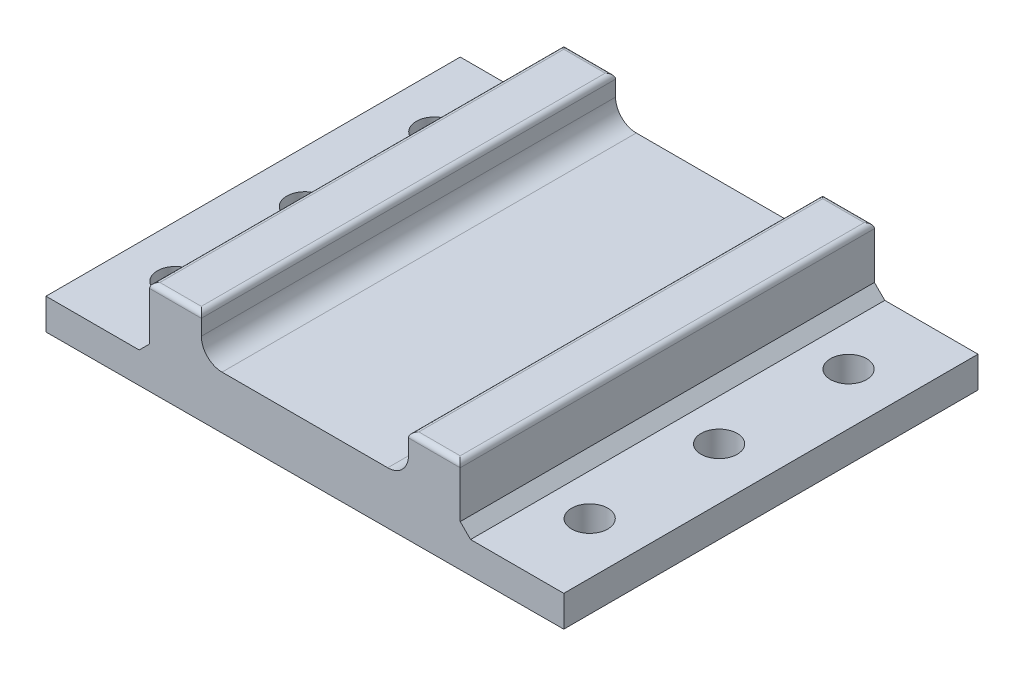
ISO-10303-21;
HEADER;
FILE_DESCRIPTION(('STEP AP214'),'2;1');
FILE_NAME('part.step','',(''),(''),'','','');
FILE_SCHEMA(('AUTOMOTIVE_DESIGN { 1 0 10303 214 1 1 1 1 }'));
ENDSEC;
DATA;
#1=APPLICATION_CONTEXT('core data for automotive mechanical design processes');
#2=APPLICATION_PROTOCOL_DEFINITION('international standard','automotive_design',2000,#1);
#3=PRODUCT_CONTEXT('',#1,'mechanical');
#4=PRODUCT('Part','Part','',(#3));
#5=PRODUCT_RELATED_PRODUCT_CATEGORY('part','',(#4));
#6=PRODUCT_DEFINITION_FORMATION('','',#4);
#7=PRODUCT_DEFINITION_CONTEXT('part definition',#1,'design');
#8=PRODUCT_DEFINITION('design','',#6,#7);
#9=PRODUCT_DEFINITION_SHAPE('','',#8);
#10=(LENGTH_UNIT() NAMED_UNIT(*) SI_UNIT(.MILLI.,.METRE.));
#11=(NAMED_UNIT(*) PLANE_ANGLE_UNIT() SI_UNIT($,.RADIAN.));
#12=(NAMED_UNIT(*) SI_UNIT($,.STERADIAN.) SOLID_ANGLE_UNIT());
#13=UNCERTAINTY_MEASURE_WITH_UNIT(LENGTH_MEASURE(1.E-05),#10,'distance_accuracy_value','');
#14=(GEOMETRIC_REPRESENTATION_CONTEXT(3) GLOBAL_UNCERTAINTY_ASSIGNED_CONTEXT((#13)) GLOBAL_UNIT_ASSIGNED_CONTEXT((#10,
#11,#12)) REPRESENTATION_CONTEXT('',''));
#15=CARTESIAN_POINT('',(0.,0.,0.));
#16=DIRECTION('',(0.,0.,1.));
#17=DIRECTION('',(1.,0.,0.));
#18=AXIS2_PLACEMENT_3D('',#15,#16,#17);
#19=CARTESIAN_POINT('',(0.,-12.2989214175655,-80.));
#20=DIRECTION('',(-1.,0.,0.));
#21=DIRECTION('',(0.,0.,1.));
#22=AXIS2_PLACEMENT_3D('',#19,#20,#21);
#23=PLANE('',#22);
#24=DIRECTION('',(0.,-1.,0.));
#25=VECTOR('',#24,1.);
#26=CARTESIAN_POINT('',(0.,-12.2989214175655,0.));
#27=LINE('',#26,#25);
#28=CARTESIAN_POINT('',(0.,-1.,0.));
#29=VERTEX_POINT('',#28);
#30=CARTESIAN_POINT('',(0.,-10.2989214175655,0.));
#31=VERTEX_POINT('',#30);
#32=EDGE_CURVE('E228',#29,#31,#27,.T.);
#33=ORIENTED_EDGE('',*,*,#32,.F.);
#34=DIRECTION('',(0.,0.,1.));
#35=VECTOR('',#34,1.);
#36=CARTESIAN_POINT('',(0.,-1.,-80.));
#37=LINE('',#36,#35);
#38=CARTESIAN_POINT('',(0.,-1.,-80.));
#39=VERTEX_POINT('',#38);
#40=EDGE_CURVE('E315',#29,#39,#37,.F.);
#41=ORIENTED_EDGE('',*,*,#40,.T.);
#42=DIRECTION('',(0.,-1.,0.));
#43=VECTOR('',#42,1.);
#44=CARTESIAN_POINT('',(0.,-12.2989214175655,-80.));
#45=LINE('',#44,#43);
#46=CARTESIAN_POINT('',(0.,-10.2989214175655,-80.));
#47=VERTEX_POINT('',#46);
#48=EDGE_CURVE('E192',#39,#47,#45,.T.);
#49=ORIENTED_EDGE('',*,*,#48,.T.);
#50=DIRECTION('',(0.,0.,1.));
#51=VECTOR('',#50,1.);
#52=CARTESIAN_POINT('',(0.,-10.2989214175655,0.));
#53=LINE('',#52,#51);
#54=EDGE_CURVE('E256',#47,#31,#53,.T.);
#55=ORIENTED_EDGE('',*,*,#54,.T.);
#56=EDGE_LOOP('',(#33,#41,#49,#55));
#57=FACE_BOUND('',#56,.T.);
#58=ADVANCED_FACE('F41',(#57),#23,.T.);
#59=CARTESIAN_POINT('',(0.,0.,-80.));
#60=DIRECTION('',(0.,1.,0.));
#61=DIRECTION('',(0.,0.,1.));
#62=AXIS2_PLACEMENT_3D('',#59,#60,#61);
#63=PLANE('',#62);
#64=DIRECTION('',(-1.,0.,0.));
#65=VECTOR('',#64,1.);
#66=CARTESIAN_POINT('',(0.,0.,-79.));
#67=LINE('',#66,#65);
#68=CARTESIAN_POINT('',(9.,0.,-79.));
#69=VERTEX_POINT('',#68);
#70=CARTESIAN_POINT('',(1.,0.,-79.));
#71=VERTEX_POINT('',#70);
#72=EDGE_CURVE('E310',#69,#71,#67,.T.);
#73=ORIENTED_EDGE('',*,*,#72,.T.);
#74=DIRECTION('',(0.,0.,1.));
#75=VECTOR('',#74,1.);
#76=CARTESIAN_POINT('',(1.,0.,-80.));
#77=LINE('',#76,#75);
#78=CARTESIAN_POINT('',(1.,0.,-1.));
#79=VERTEX_POINT('',#78);
#80=EDGE_CURVE('E312',#71,#79,#77,.T.);
#81=ORIENTED_EDGE('',*,*,#80,.T.);
#82=DIRECTION('',(-1.,0.,0.));
#83=VECTOR('',#82,1.);
#84=CARTESIAN_POINT('',(10.,0.,-1.));
#85=LINE('',#84,#83);
#86=CARTESIAN_POINT('',(9.,0.,-1.));
#87=VERTEX_POINT('',#86);
#88=EDGE_CURVE('E306',#79,#87,#85,.F.);
#89=ORIENTED_EDGE('',*,*,#88,.T.);
#90=DIRECTION('',(0.,0.,1.));
#91=VECTOR('',#90,1.);
#92=CARTESIAN_POINT('',(9.,0.,-80.));
#93=LINE('',#92,#91);
#94=EDGE_CURVE('E308',#87,#69,#93,.F.);
#95=ORIENTED_EDGE('',*,*,#94,.T.);
#96=EDGE_LOOP('',(#73,#81,#89,#95));
#97=FACE_BOUND('',#96,.T.);
#98=ADVANCED_FACE('F441',(#97),#63,.T.);
#99=CARTESIAN_POINT('',(10.,0.,-80.));
#100=DIRECTION('',(1.,0.,0.));
#101=DIRECTION('',(0.,1.,0.));
#102=AXIS2_PLACEMENT_3D('',#99,#100,#101);
#103=PLANE('',#102);
#104=DIRECTION('',(0.,1.,0.));
#105=VECTOR('',#104,1.);
#106=CARTESIAN_POINT('',(10.,0.,-80.));
#107=LINE('',#106,#105);
#108=CARTESIAN_POINT('',(10.,-4.,-80.));
#109=VERTEX_POINT('',#108);
#110=CARTESIAN_POINT('',(10.,-1.,-80.));
#111=VERTEX_POINT('',#110);
#112=EDGE_CURVE('E200',#109,#111,#107,.T.);
#113=ORIENTED_EDGE('',*,*,#112,.T.);
#114=DIRECTION('',(0.,0.,1.));
#115=VECTOR('',#114,1.);
#116=CARTESIAN_POINT('',(10.,-1.,-80.));
#117=LINE('',#116,#115);
#118=CARTESIAN_POINT('',(10.,-1.,0.));
#119=VERTEX_POINT('',#118);
#120=EDGE_CURVE('E322',#111,#119,#117,.T.);
#121=ORIENTED_EDGE('',*,*,#120,.T.);
#122=DIRECTION('',(0.,1.,0.));
#123=VECTOR('',#122,1.);
#124=CARTESIAN_POINT('',(10.,0.,0.));
#125=LINE('',#124,#123);
#126=CARTESIAN_POINT('',(10.,-4.,0.));
#127=VERTEX_POINT('',#126);
#128=EDGE_CURVE('E251',#127,#119,#125,.T.);
#129=ORIENTED_EDGE('',*,*,#128,.F.);
#130=DIRECTION('',(0.,0.,1.));
#131=VECTOR('',#130,1.);
#132=CARTESIAN_POINT('',(10.,-4.,-80.));
#133=LINE('',#132,#131);
#134=EDGE_CURVE('E295',#127,#109,#133,.F.);
#135=ORIENTED_EDGE('',*,*,#134,.T.);
#136=EDGE_LOOP('',(#113,#121,#129,#135));
#137=FACE_BOUND('',#136,.T.);
#138=ADVANCED_FACE('F446',(#137),#103,.T.);
#139=CARTESIAN_POINT('',(10.,-8.,-80.));
#140=DIRECTION('',(0.,1.,0.));
#141=DIRECTION('',(0.,0.,1.));
#142=AXIS2_PLACEMENT_3D('',#139,#140,#141);
#143=PLANE('',#142);
#144=DIRECTION('',(-1.,0.,0.));
#145=VECTOR('',#144,1.);
#146=CARTESIAN_POINT('',(10.,-8.,0.));
#147=LINE('',#146,#145);
#148=CARTESIAN_POINT('',(46.,-8.,0.));
#149=VERTEX_POINT('',#148);
#150=CARTESIAN_POINT('',(14.,-8.,0.));
#151=VERTEX_POINT('',#150);
#152=EDGE_CURVE('E248',#149,#151,#147,.T.);
#153=ORIENTED_EDGE('',*,*,#152,.F.);
#154=DIRECTION('',(0.,0.,1.));
#155=VECTOR('',#154,1.);
#156=CARTESIAN_POINT('',(46.,-8.,-80.));
#157=LINE('',#156,#155);
#158=CARTESIAN_POINT('',(46.,-8.,-80.));
#159=VERTEX_POINT('',#158);
#160=EDGE_CURVE('E293',#149,#159,#157,.F.);
#161=ORIENTED_EDGE('',*,*,#160,.T.);
#162=DIRECTION('',(-1.,0.,0.));
#163=VECTOR('',#162,1.);
#164=CARTESIAN_POINT('',(10.,-8.,-80.));
#165=LINE('',#164,#163);
#166=CARTESIAN_POINT('',(14.,-8.,-80.));
#167=VERTEX_POINT('',#166);
#168=EDGE_CURVE('E223',#159,#167,#165,.T.);
#169=ORIENTED_EDGE('',*,*,#168,.T.);
#170=DIRECTION('',(0.,0.,1.));
#171=VECTOR('',#170,1.);
#172=CARTESIAN_POINT('',(14.,-8.,0.));
#173=LINE('',#172,#171);
#174=EDGE_CURVE('E290',#167,#151,#173,.T.);
#175=ORIENTED_EDGE('',*,*,#174,.T.);
#176=EDGE_LOOP('',(#153,#161,#169,#175));
#177=FACE_BOUND('',#176,.T.);
#178=ADVANCED_FACE('F547',(#177),#143,.T.);
#179=CARTESIAN_POINT('',(50.,-8.,-80.));
#180=DIRECTION('',(-1.,0.,0.));
#181=DIRECTION('',(0.,0.,1.));
#182=AXIS2_PLACEMENT_3D('',#179,#180,#181);
#183=PLANE('',#182);
#184=DIRECTION('',(0.,-1.,0.));
#185=VECTOR('',#184,1.);
#186=CARTESIAN_POINT('',(50.,-8.,0.));
#187=LINE('',#186,#185);
#188=CARTESIAN_POINT('',(50.,-1.,0.));
#189=VERTEX_POINT('',#188);
#190=CARTESIAN_POINT('',(50.,-4.,0.));
#191=VERTEX_POINT('',#190);
#192=EDGE_CURVE('E246',#189,#191,#187,.T.);
#193=ORIENTED_EDGE('',*,*,#192,.F.);
#194=DIRECTION('',(0.,0.,1.));
#195=VECTOR('',#194,1.);
#196=CARTESIAN_POINT('',(50.,-1.,-80.));
#197=LINE('',#196,#195);
#198=CARTESIAN_POINT('',(50.,-1.,-80.));
#199=VERTEX_POINT('',#198);
#200=EDGE_CURVE('E50',#189,#199,#197,.F.);
#201=ORIENTED_EDGE('',*,*,#200,.T.);
#202=DIRECTION('',(0.,-1.,0.));
#203=VECTOR('',#202,1.);
#204=CARTESIAN_POINT('',(50.,-8.,-80.));
#205=LINE('',#204,#203);
#206=CARTESIAN_POINT('',(50.,-4.,-80.));
#207=VERTEX_POINT('',#206);
#208=EDGE_CURVE('E221',#199,#207,#205,.T.);
#209=ORIENTED_EDGE('',*,*,#208,.T.);
#210=DIRECTION('',(0.,0.,1.));
#211=VECTOR('',#210,1.);
#212=CARTESIAN_POINT('',(50.,-4.,0.));
#213=LINE('',#212,#211);
#214=EDGE_CURVE('E287',#207,#191,#213,.T.);
#215=ORIENTED_EDGE('',*,*,#214,.T.);
#216=EDGE_LOOP('',(#193,#201,#209,#215));
#217=FACE_BOUND('',#216,.T.);
#218=ADVANCED_FACE('F549',(#217),#183,.T.);
#219=CARTESIAN_POINT('',(50.,0.,-80.));
#220=DIRECTION('',(0.,1.,0.));
#221=DIRECTION('',(0.,0.,1.));
#222=AXIS2_PLACEMENT_3D('',#219,#220,#221);
#223=PLANE('',#222);
#224=DIRECTION('',(-1.,0.,0.));
#225=VECTOR('',#224,1.);
#226=CARTESIAN_POINT('',(50.,0.,-79.));
#227=LINE('',#226,#225);
#228=CARTESIAN_POINT('',(59.,0.,-79.));
#229=VERTEX_POINT('',#228);
#230=CARTESIAN_POINT('',(51.,0.,-79.));
#231=VERTEX_POINT('',#230);
#232=EDGE_CURVE('E58',#229,#231,#227,.T.);
#233=ORIENTED_EDGE('',*,*,#232,.T.);
#234=DIRECTION('',(0.,0.,1.));
#235=VECTOR('',#234,1.);
#236=CARTESIAN_POINT('',(51.,0.,-80.));
#237=LINE('',#236,#235);
#238=CARTESIAN_POINT('',(51.,0.,-1.));
#239=VERTEX_POINT('',#238);
#240=EDGE_CURVE('E332',#231,#239,#237,.T.);
#241=ORIENTED_EDGE('',*,*,#240,.T.);
#242=DIRECTION('',(-1.,0.,0.));
#243=VECTOR('',#242,1.);
#244=CARTESIAN_POINT('',(60.,0.,-1.));
#245=LINE('',#244,#243);
#246=CARTESIAN_POINT('',(59.,0.,-1.));
#247=VERTEX_POINT('',#246);
#248=EDGE_CURVE('E328',#239,#247,#245,.F.);
#249=ORIENTED_EDGE('',*,*,#248,.T.);
#250=DIRECTION('',(0.,0.,1.));
#251=VECTOR('',#250,1.);
#252=CARTESIAN_POINT('',(59.,0.,-80.));
#253=LINE('',#252,#251);
#254=EDGE_CURVE('E63',#247,#229,#253,.F.);
#255=ORIENTED_EDGE('',*,*,#254,.T.);
#256=EDGE_LOOP('',(#233,#241,#249,#255));
#257=FACE_BOUND('',#256,.T.);
#258=ADVANCED_FACE('F562',(#257),#223,.T.);
#259=CARTESIAN_POINT('',(60.,0.,-80.));
#260=DIRECTION('',(1.,0.,0.));
#261=DIRECTION('',(0.,0.,-1.));
#262=AXIS2_PLACEMENT_3D('',#259,#260,#261);
#263=PLANE('',#262);
#264=DIRECTION('',(0.,1.,0.));
#265=VECTOR('',#264,1.);
#266=CARTESIAN_POINT('',(60.,0.,-80.));
#267=LINE('',#266,#265);
#268=CARTESIAN_POINT('',(60.,-10.,-80.));
#269=VERTEX_POINT('',#268);
#270=CARTESIAN_POINT('',(60.,-1.,-80.));
#271=VERTEX_POINT('',#270);
#272=EDGE_CURVE('E218',#269,#271,#267,.T.);
#273=ORIENTED_EDGE('',*,*,#272,.T.);
#274=DIRECTION('',(0.,0.,1.));
#275=VECTOR('',#274,1.);
#276=CARTESIAN_POINT('',(60.,-1.,-80.));
#277=LINE('',#276,#275);
#278=CARTESIAN_POINT('',(60.,-1.,0.));
#279=VERTEX_POINT('',#278);
#280=EDGE_CURVE('E11',#271,#279,#277,.T.);
#281=ORIENTED_EDGE('',*,*,#280,.T.);
#282=DIRECTION('',(0.,1.,0.));
#283=VECTOR('',#282,1.);
#284=CARTESIAN_POINT('',(60.,0.,0.));
#285=LINE('',#284,#283);
#286=CARTESIAN_POINT('',(60.,-10.,0.));
#287=VERTEX_POINT('',#286);
#288=EDGE_CURVE('E243',#287,#279,#285,.T.);
#289=ORIENTED_EDGE('',*,*,#288,.F.);
#290=DIRECTION('',(0.,0.,-1.));
#291=VECTOR('',#290,1.);
#292=CARTESIAN_POINT('',(60.,-10.,-80.));
#293=LINE('',#292,#291);
#294=EDGE_CURVE('E277',#287,#269,#293,.T.);
#295=ORIENTED_EDGE('',*,*,#294,.T.);
#296=EDGE_LOOP('',(#273,#281,#289,#295));
#297=FACE_BOUND('',#296,.T.);
#298=ADVANCED_FACE('F364',(#297),#263,.T.);
#299=CARTESIAN_POINT('',(60.,-12.,-80.));
#300=DIRECTION('',(0.,1.,0.));
#301=DIRECTION('',(-1.,0.,0.));
#302=AXIS2_PLACEMENT_3D('',#299,#300,#301);
#303=PLANE('',#302);
#304=CARTESIAN_POINT('',(70.,-12.,-65.));
#305=DIRECTION('',(0.,1.,0.));
#306=DIRECTION('',(-1.,0.,0.));
#307=AXIS2_PLACEMENT_3D('',#304,#305,#306);
#308=CIRCLE('',#307,3.50000000000001);
#309=CARTESIAN_POINT('',(66.5,-12.,-65.));
#310=VERTEX_POINT('',#309);
#311=EDGE_CURVE('E264',#310,#310,#308,.T.);
#312=ORIENTED_EDGE('',*,*,#311,.F.);
#313=EDGE_LOOP('',(#312));
#314=FACE_BOUND('',#313,.T.);
#315=CARTESIAN_POINT('',(70.,-12.,-40.));
#316=DIRECTION('',(0.,1.,0.));
#317=DIRECTION('',(-1.,0.,0.));
#318=AXIS2_PLACEMENT_3D('',#315,#316,#317);
#319=CIRCLE('',#318,3.50000000000001);
#320=CARTESIAN_POINT('',(66.5,-12.,-40.));
#321=VERTEX_POINT('',#320);
#322=EDGE_CURVE('E410',#321,#321,#319,.T.);
#323=ORIENTED_EDGE('',*,*,#322,.F.);
#324=EDGE_LOOP('',(#323));
#325=FACE_BOUND('',#324,.T.);
#326=CARTESIAN_POINT('',(70.,-12.,-15.));
#327=DIRECTION('',(0.,1.,0.));
#328=DIRECTION('',(-1.,0.,0.));
#329=AXIS2_PLACEMENT_3D('',#326,#327,#328);
#330=CIRCLE('',#329,3.50000000000001);
#331=CARTESIAN_POINT('',(66.5,-12.,-15.));
#332=VERTEX_POINT('',#331);
#333=EDGE_CURVE('E346',#332,#332,#330,.T.);
#334=ORIENTED_EDGE('',*,*,#333,.F.);
#335=EDGE_LOOP('',(#334));
#336=FACE_BOUND('',#335,.T.);
#337=DIRECTION('',(-1.,0.,0.));
#338=VECTOR('',#337,1.);
#339=CARTESIAN_POINT('',(60.,-12.,-80.));
#340=LINE('',#339,#338);
#341=CARTESIAN_POINT('',(80.,-12.,-80.));
#342=VERTEX_POINT('',#341);
#343=CARTESIAN_POINT('',(62.,-12.,-80.));
#344=VERTEX_POINT('',#343);
#345=EDGE_CURVE('E215',#342,#344,#340,.T.);
#346=ORIENTED_EDGE('',*,*,#345,.T.);
#347=DIRECTION('',(0.,0.,1.));
#348=VECTOR('',#347,1.);
#349=CARTESIAN_POINT('',(62.,-12.,0.));
#350=LINE('',#349,#348);
#351=CARTESIAN_POINT('',(62.,-12.,0.));
#352=VERTEX_POINT('',#351);
#353=EDGE_CURVE('E274',#344,#352,#350,.T.);
#354=ORIENTED_EDGE('',*,*,#353,.T.);
#355=DIRECTION('',(-1.,0.,0.));
#356=VECTOR('',#355,1.);
#357=CARTESIAN_POINT('',(60.,-12.,0.));
#358=LINE('',#357,#356);
#359=CARTESIAN_POINT('',(80.,-12.,0.));
#360=VERTEX_POINT('',#359);
#361=EDGE_CURVE('E240',#360,#352,#358,.T.);
#362=ORIENTED_EDGE('',*,*,#361,.F.);
#363=DIRECTION('',(0.,0.,1.));
#364=VECTOR('',#363,1.);
#365=CARTESIAN_POINT('',(80.,-12.,-80.));
#366=LINE('',#365,#364);
#367=EDGE_CURVE('E254',#342,#360,#366,.T.);
#368=ORIENTED_EDGE('',*,*,#367,.F.);
#369=EDGE_LOOP('',(#346,#354,#362,#368));
#370=FACE_BOUND('',#369,.T.);
#371=ADVANCED_FACE('F376',(#314,#325,#336,#370),#303,.T.);
#372=CARTESIAN_POINT('',(80.,-12.,-80.));
#373=DIRECTION('',(1.,0.,0.));
#374=DIRECTION('',(0.,0.,-1.));
#375=AXIS2_PLACEMENT_3D('',#372,#373,#374);
#376=PLANE('',#375);
#377=DIRECTION('',(0.,1.,0.));
#378=VECTOR('',#377,1.);
#379=CARTESIAN_POINT('',(80.,-12.,0.));
#380=LINE('',#379,#378);
#381=CARTESIAN_POINT('',(80.,-18.,0.));
#382=VERTEX_POINT('',#381);
#383=EDGE_CURVE('E237',#382,#360,#380,.T.);
#384=ORIENTED_EDGE('',*,*,#383,.F.);
#385=DIRECTION('',(0.,0.,1.));
#386=VECTOR('',#385,1.);
#387=CARTESIAN_POINT('',(80.,-18.,-80.));
#388=LINE('',#387,#386);
#389=CARTESIAN_POINT('',(80.,-18.,-80.));
#390=VERTEX_POINT('',#389);
#391=EDGE_CURVE('E257',#390,#382,#388,.T.);
#392=ORIENTED_EDGE('',*,*,#391,.F.);
#393=DIRECTION('',(0.,1.,0.));
#394=VECTOR('',#393,1.);
#395=CARTESIAN_POINT('',(80.,-12.,-80.));
#396=LINE('',#395,#394);
#397=EDGE_CURVE('E209',#390,#342,#396,.T.);
#398=ORIENTED_EDGE('',*,*,#397,.T.);
#399=ORIENTED_EDGE('',*,*,#367,.T.);
#400=EDGE_LOOP('',(#384,#392,#398,#399));
#401=FACE_BOUND('',#400,.T.);
#402=ADVANCED_FACE('F380',(#401),#376,.T.);
#403=CARTESIAN_POINT('',(80.,-18.,-80.));
#404=DIRECTION('',(0.0029892008208298,-0.999995532329246,0.));
#405=DIRECTION('',(0.999995532329247,0.0029892008208298,0.));
#406=AXIS2_PLACEMENT_3D('',#403,#404,#405);
#407=PLANE('',#406);
#408=CARTESIAN_POINT('',(70.,-18.0298921417566,-65.));
#409=DIRECTION('',(0.0029892008208298,-0.999995532329246,0.));
#410=DIRECTION('',(0.999995532329246,0.0029892008208298,0.));
#411=AXIS2_PLACEMENT_3D('',#408,#409,#410);
#412=ELLIPSE('',#411,3.50001563691751,3.50000000000001);
#413=CARTESIAN_POINT('',(73.5,-18.0194298921418,-65.));
#414=VERTEX_POINT('',#413);
#415=EDGE_CURVE('E267',#414,#414,#412,.T.);
#416=ORIENTED_EDGE('',*,*,#415,.F.);
#417=EDGE_LOOP('',(#416));
#418=FACE_BOUND('',#417,.T.);
#419=CARTESIAN_POINT('',(70.,-18.0298921417566,-40.));
#420=DIRECTION('',(0.0029892008208298,-0.999995532329246,0.));
#421=DIRECTION('',(0.999995532329246,0.0029892008208298,0.));
#422=AXIS2_PLACEMENT_3D('',#419,#420,#421);
#423=ELLIPSE('',#422,3.50001563691751,3.50000000000001);
#424=CARTESIAN_POINT('',(73.5,-18.0194298921418,-40.));
#425=VERTEX_POINT('',#424);
#426=EDGE_CURVE('E263',#425,#425,#423,.T.);
#427=ORIENTED_EDGE('',*,*,#426,.F.);
#428=EDGE_LOOP('',(#427));
#429=FACE_BOUND('',#428,.T.);
#430=CARTESIAN_POINT('',(70.,-18.0298921417566,-15.));
#431=DIRECTION('',(0.0029892008208298,-0.999995532329246,0.));
#432=DIRECTION('',(0.999995532329246,0.0029892008208298,0.));
#433=AXIS2_PLACEMENT_3D('',#430,#431,#432);
#434=ELLIPSE('',#433,3.50001563691751,3.50000000000001);
#435=CARTESIAN_POINT('',(73.5,-18.0194298921418,-15.));
#436=VERTEX_POINT('',#435);
#437=EDGE_CURVE('E260',#436,#436,#434,.T.);
#438=ORIENTED_EDGE('',*,*,#437,.F.);
#439=EDGE_LOOP('',(#438));
#440=FACE_BOUND('',#439,.T.);
#441=CARTESIAN_POINT('',(-10.,-18.2690292758089,-65.));
#442=DIRECTION('',(0.0029892008208298,-0.999995532329246,0.));
#443=DIRECTION('',(0.999995532329246,0.0029892008208298,0.));
#444=AXIS2_PLACEMENT_3D('',#441,#442,#443);
#445=ELLIPSE('',#444,3.5000156369175,3.5);
#446=CARTESIAN_POINT('',(-6.5,-18.2585670261941,-65.));
#447=VERTEX_POINT('',#446);
#448=EDGE_CURVE('E231',#447,#447,#445,.T.);
#449=ORIENTED_EDGE('',*,*,#448,.F.);
#450=EDGE_LOOP('',(#449));
#451=FACE_BOUND('',#450,.T.);
#452=CARTESIAN_POINT('',(-10.,-18.2690292758089,-40.));
#453=DIRECTION('',(0.0029892008208298,-0.999995532329246,0.));
#454=DIRECTION('',(0.999995532329246,0.0029892008208298,0.));
#455=AXIS2_PLACEMENT_3D('',#452,#453,#454);
#456=ELLIPSE('',#455,3.5000156369175,3.5);
#457=CARTESIAN_POINT('',(-6.5,-18.2585670261941,-40.));
#458=VERTEX_POINT('',#457);
#459=EDGE_CURVE('E394',#458,#458,#456,.T.);
#460=ORIENTED_EDGE('',*,*,#459,.F.);
#461=EDGE_LOOP('',(#460));
#462=FACE_BOUND('',#461,.T.);
#463=CARTESIAN_POINT('',(-9.99999999999999,-18.2690292758089,-15.));
#464=DIRECTION('',(0.0029892008208298,-0.999995532329246,0.));
#465=DIRECTION('',(0.999995532329246,0.0029892008208298,0.));
#466=AXIS2_PLACEMENT_3D('',#463,#464,#465);
#467=ELLIPSE('',#466,3.5000156369175,3.5);
#468=CARTESIAN_POINT('',(-6.49999999999999,-18.2585670261941,-15.));
#469=VERTEX_POINT('',#468);
#470=EDGE_CURVE('E397',#469,#469,#467,.T.);
#471=ORIENTED_EDGE('',*,*,#470,.F.);
#472=EDGE_LOOP('',(#471));
#473=FACE_BOUND('',#472,.T.);
#474=DIRECTION('',(0.999995532329246,0.0029892008208298,0.));
#475=VECTOR('',#474,1.);
#476=CARTESIAN_POINT('',(80.,-18.,0.));
#477=LINE('',#476,#475);
#478=CARTESIAN_POINT('',(-20.,-18.2989214175655,0.));
#479=VERTEX_POINT('',#478);
#480=EDGE_CURVE('E234',#479,#382,#477,.T.);
#481=ORIENTED_EDGE('',*,*,#480,.F.);
#482=DIRECTION('',(0.,0.,1.));
#483=VECTOR('',#482,1.);
#484=CARTESIAN_POINT('',(-20.,-18.2989214175655,-80.));
#485=LINE('',#484,#483);
#486=CARTESIAN_POINT('',(-20.,-18.2989214175655,-80.));
#487=VERTEX_POINT('',#486);
#488=EDGE_CURVE('E199',#487,#479,#485,.T.);
#489=ORIENTED_EDGE('',*,*,#488,.F.);
#490=DIRECTION('',(0.999995532329246,0.0029892008208298,0.));
#491=VECTOR('',#490,1.);
#492=CARTESIAN_POINT('',(80.,-18.,-80.));
#493=LINE('',#492,#491);
#494=EDGE_CURVE('E207',#487,#390,#493,.T.);
#495=ORIENTED_EDGE('',*,*,#494,.T.);
#496=ORIENTED_EDGE('',*,*,#391,.T.);
#497=EDGE_LOOP('',(#481,#489,#495,#496));
#498=FACE_BOUND('',#497,.T.);
#499=ADVANCED_FACE('F383',(#418,#429,#440,#451,#462,#473,#498),#407,.T.);
#500=CARTESIAN_POINT('',(-20.,-18.2989214175655,-80.));
#501=DIRECTION('',(-1.,0.,0.));
#502=DIRECTION('',(0.,-1.,0.));
#503=AXIS2_PLACEMENT_3D('',#500,#501,#502);
#504=PLANE('',#503);
#505=DIRECTION('',(0.,-1.,0.));
#506=VECTOR('',#505,1.);
#507=CARTESIAN_POINT('',(-20.,-18.2989214175655,0.));
#508=LINE('',#507,#506);
#509=CARTESIAN_POINT('',(-20.,-12.2989214175655,0.));
#510=VERTEX_POINT('',#509);
#511=EDGE_CURVE('E198',#510,#479,#508,.T.);
#512=ORIENTED_EDGE('',*,*,#511,.F.);
#513=DIRECTION('',(0.,0.,1.));
#514=VECTOR('',#513,1.);
#515=CARTESIAN_POINT('',(-20.,-12.2989214175655,-80.));
#516=LINE('',#515,#514);
#517=CARTESIAN_POINT('',(-20.,-12.2989214175655,-80.));
#518=VERTEX_POINT('',#517);
#519=EDGE_CURVE('E183',#518,#510,#516,.T.);
#520=ORIENTED_EDGE('',*,*,#519,.F.);
#521=DIRECTION('',(0.,-1.,0.));
#522=VECTOR('',#521,1.);
#523=CARTESIAN_POINT('',(-20.,-18.2989214175655,-80.));
#524=LINE('',#523,#522);
#525=EDGE_CURVE('E191',#518,#487,#524,.T.);
#526=ORIENTED_EDGE('',*,*,#525,.T.);
#527=ORIENTED_EDGE('',*,*,#488,.T.);
#528=EDGE_LOOP('',(#512,#520,#526,#527));
#529=FACE_BOUND('',#528,.T.);
#530=ADVANCED_FACE('F196',(#529),#504,.T.);
#531=CARTESIAN_POINT('',(-20.,-12.2989214175655,-80.));
#532=DIRECTION('',(0.,1.,0.));
#533=DIRECTION('',(-1.,0.,0.));
#534=AXIS2_PLACEMENT_3D('',#531,#532,#533);
#535=PLANE('',#534);
#536=CARTESIAN_POINT('',(-10.,-12.2989214175655,-65.));
#537=DIRECTION('',(0.,1.,0.));
#538=DIRECTION('',(-1.,0.,0.));
#539=AXIS2_PLACEMENT_3D('',#536,#537,#538);
#540=CIRCLE('',#539,3.5);
#541=CARTESIAN_POINT('',(-13.5,-12.2989214175655,-65.));
#542=VERTEX_POINT('',#541);
#543=EDGE_CURVE('E400',#542,#542,#540,.T.);
#544=ORIENTED_EDGE('',*,*,#543,.F.);
#545=EDGE_LOOP('',(#544));
#546=FACE_BOUND('',#545,.T.);
#547=CARTESIAN_POINT('',(-10.,-12.2989214175655,-40.));
#548=DIRECTION('',(0.,1.,0.));
#549=DIRECTION('',(-1.,0.,0.));
#550=AXIS2_PLACEMENT_3D('',#547,#548,#549);
#551=CIRCLE('',#550,3.5);
#552=CARTESIAN_POINT('',(-13.5,-12.2989214175655,-40.));
#553=VERTEX_POINT('',#552);
#554=EDGE_CURVE('E403',#553,#553,#551,.T.);
#555=ORIENTED_EDGE('',*,*,#554,.F.);
#556=EDGE_LOOP('',(#555));
#557=FACE_BOUND('',#556,.T.);
#558=CARTESIAN_POINT('',(-9.99999999999999,-12.2989214175655,-15.));
#559=DIRECTION('',(0.,1.,0.));
#560=DIRECTION('',(-1.,0.,0.));
#561=AXIS2_PLACEMENT_3D('',#558,#559,#560);
#562=CIRCLE('',#561,3.5);
#563=CARTESIAN_POINT('',(-13.5,-12.2989214175655,-15.));
#564=VERTEX_POINT('',#563);
#565=EDGE_CURVE('E270',#564,#564,#562,.T.);
#566=ORIENTED_EDGE('',*,*,#565,.F.);
#567=EDGE_LOOP('',(#566));
#568=FACE_BOUND('',#567,.T.);
#569=DIRECTION('',(-1.,0.,0.));
#570=VECTOR('',#569,1.);
#571=CARTESIAN_POINT('',(-20.,-12.2989214175655,0.));
#572=LINE('',#571,#570);
#573=CARTESIAN_POINT('',(-2.00000000000002,-12.2989214175655,0.));
#574=VERTEX_POINT('',#573);
#575=EDGE_CURVE('E230',#574,#510,#572,.T.);
#576=ORIENTED_EDGE('',*,*,#575,.F.);
#577=DIRECTION('',(0.,0.,-1.));
#578=VECTOR('',#577,1.);
#579=CARTESIAN_POINT('',(-2.00000000000002,-12.2989214175655,-80.));
#580=LINE('',#579,#578);
#581=CARTESIAN_POINT('',(-2.00000000000002,-12.2989214175655,-80.));
#582=VERTEX_POINT('',#581);
#583=EDGE_CURVE('E186',#574,#582,#580,.T.);
#584=ORIENTED_EDGE('',*,*,#583,.T.);
#585=DIRECTION('',(-1.,0.,0.));
#586=VECTOR('',#585,1.);
#587=CARTESIAN_POINT('',(-20.,-12.2989214175655,-80.));
#588=LINE('',#587,#586);
#589=EDGE_CURVE('E179',#582,#518,#588,.T.);
#590=ORIENTED_EDGE('',*,*,#589,.T.);
#591=ORIENTED_EDGE('',*,*,#519,.T.);
#592=EDGE_LOOP('',(#576,#584,#590,#591));
#593=FACE_BOUND('',#592,.T.);
#594=ADVANCED_FACE('F182',(#546,#557,#568,#593),#535,.T.);
#595=CARTESIAN_POINT('',(0.,0.,-80.));
#596=DIRECTION('',(0.,0.,-1.));
#597=DIRECTION('',(-1.,0.,0.));
#598=AXIS2_PLACEMENT_3D('',#595,#596,#597);
#599=PLANE('',#598);
#600=ORIENTED_EDGE('',*,*,#48,.F.);
#601=DIRECTION('',(-1.,0.,0.));
#602=VECTOR('',#601,1.);
#603=CARTESIAN_POINT('',(0.,-1.,-80.));
#604=LINE('',#603,#602);
#605=EDGE_CURVE('E320',#39,#111,#604,.F.);
#606=ORIENTED_EDGE('',*,*,#605,.T.);
#607=ORIENTED_EDGE('',*,*,#112,.F.);
#608=CARTESIAN_POINT('',(14.,-4.,-80.));
#609=DIRECTION('',(0.,0.,-1.));
#610=DIRECTION('',(-1.,0.,0.));
#611=AXIS2_PLACEMENT_3D('',#608,#609,#610);
#612=CIRCLE('',#611,4.);
#613=EDGE_CURVE('E304',#109,#167,#612,.F.);
#614=ORIENTED_EDGE('',*,*,#613,.T.);
#615=ORIENTED_EDGE('',*,*,#168,.F.);
#616=CARTESIAN_POINT('',(46.,-4.,-80.));
#617=DIRECTION('',(0.,0.,-1.));
#618=DIRECTION('',(-1.,0.,0.));
#619=AXIS2_PLACEMENT_3D('',#616,#617,#618);
#620=CIRCLE('',#619,4.);
#621=EDGE_CURVE('E299',#159,#207,#620,.F.);
#622=ORIENTED_EDGE('',*,*,#621,.T.);
#623=ORIENTED_EDGE('',*,*,#208,.F.);
#624=DIRECTION('',(-1.,0.,0.));
#625=VECTOR('',#624,1.);
#626=CARTESIAN_POINT('',(0.,-1.,-80.));
#627=LINE('',#626,#625);
#628=EDGE_CURVE('E318',#199,#271,#627,.F.);
#629=ORIENTED_EDGE('',*,*,#628,.T.);
#630=ORIENTED_EDGE('',*,*,#272,.F.);
#631=DIRECTION('',(-0.707106781186552,0.707106781186543,0.));
#632=VECTOR('',#631,1.);
#633=CARTESIAN_POINT('',(62.,-12.,-80.));
#634=LINE('',#633,#632);
#635=EDGE_CURVE('E285',#269,#344,#634,.F.);
#636=ORIENTED_EDGE('',*,*,#635,.T.);
#637=ORIENTED_EDGE('',*,*,#345,.F.);
#638=ORIENTED_EDGE('',*,*,#397,.F.);
#639=ORIENTED_EDGE('',*,*,#494,.F.);
#640=ORIENTED_EDGE('',*,*,#525,.F.);
#641=ORIENTED_EDGE('',*,*,#589,.F.);
#642=DIRECTION('',(-0.707106781186545,-0.70710678118655,0.));
#643=VECTOR('',#642,1.);
#644=CARTESIAN_POINT('',(0.,-10.2989214175655,-80.));
#645=LINE('',#644,#643);
#646=EDGE_CURVE('E281',#582,#47,#645,.F.);
#647=ORIENTED_EDGE('',*,*,#646,.T.);
#648=EDGE_LOOP('',(#600,#606,#607,#614,#615,#622,#623,#629,#630,#636,#637,#638,#639,#640,#641,#647));
#649=FACE_BOUND('',#648,.T.);
#650=ADVANCED_FACE('F204',(#649),#599,.T.);
#651=CARTESIAN_POINT('',(0.,0.,0.));
#652=DIRECTION('',(0.,0.,-1.));
#653=DIRECTION('',(-1.,0.,0.));
#654=AXIS2_PLACEMENT_3D('',#651,#652,#653);
#655=PLANE('',#654);
#656=ORIENTED_EDGE('',*,*,#128,.T.);
#657=DIRECTION('',(-1.,0.,0.));
#658=VECTOR('',#657,1.);
#659=CARTESIAN_POINT('',(0.,-1.,0.));
#660=LINE('',#659,#658);
#661=EDGE_CURVE('E326',#119,#29,#660,.T.);
#662=ORIENTED_EDGE('',*,*,#661,.T.);
#663=ORIENTED_EDGE('',*,*,#32,.T.);
#664=DIRECTION('',(0.707106781186545,0.70710678118655,0.));
#665=VECTOR('',#664,1.);
#666=CARTESIAN_POINT('',(5.14946070878273,-5.14946070878269,0.));
#667=LINE('',#666,#665);
#668=EDGE_CURVE('E279',#31,#574,#667,.F.);
#669=ORIENTED_EDGE('',*,*,#668,.T.);
#670=ORIENTED_EDGE('',*,*,#575,.T.);
#671=ORIENTED_EDGE('',*,*,#511,.T.);
#672=ORIENTED_EDGE('',*,*,#480,.T.);
#673=ORIENTED_EDGE('',*,*,#383,.T.);
#674=ORIENTED_EDGE('',*,*,#361,.T.);
#675=DIRECTION('',(0.707106781186552,-0.707106781186543,0.));
#676=VECTOR('',#675,1.);
#677=CARTESIAN_POINT('',(24.9999999999996,24.9999999999999,0.));
#678=LINE('',#677,#676);
#679=EDGE_CURVE('E283',#352,#287,#678,.F.);
#680=ORIENTED_EDGE('',*,*,#679,.T.);
#681=ORIENTED_EDGE('',*,*,#288,.T.);
#682=DIRECTION('',(-1.,0.,0.));
#683=VECTOR('',#682,1.);
#684=CARTESIAN_POINT('',(50.,-1.,0.));
#685=LINE('',#684,#683);
#686=EDGE_CURVE('E324',#279,#189,#685,.T.);
#687=ORIENTED_EDGE('',*,*,#686,.T.);
#688=ORIENTED_EDGE('',*,*,#192,.T.);
#689=CARTESIAN_POINT('',(46.,-4.,0.));
#690=DIRECTION('',(0.,0.,-1.));
#691=DIRECTION('',(-1.,0.,0.));
#692=AXIS2_PLACEMENT_3D('',#689,#690,#691);
#693=CIRCLE('',#692,4.);
#694=EDGE_CURVE('E297',#191,#149,#693,.T.);
#695=ORIENTED_EDGE('',*,*,#694,.T.);
#696=ORIENTED_EDGE('',*,*,#152,.T.);
#697=CARTESIAN_POINT('',(14.,-4.,0.));
#698=DIRECTION('',(0.,0.,-1.));
#699=DIRECTION('',(-1.,0.,0.));
#700=AXIS2_PLACEMENT_3D('',#697,#698,#699);
#701=CIRCLE('',#700,4.);
#702=EDGE_CURVE('E302',#151,#127,#701,.T.);
#703=ORIENTED_EDGE('',*,*,#702,.T.);
#704=EDGE_LOOP('',(#656,#662,#663,#669,#670,#671,#672,#673,#674,#680,#681,#687,#688,#695,#696,#703));
#705=FACE_BOUND('',#704,.T.);
#706=ADVANCED_FACE('F368',(#705),#655,.F.);
#707=CARTESIAN_POINT('',(-9.99999999999999,-18.2989214175655,-15.));
#708=DIRECTION('',(0.,1.,0.));
#709=DIRECTION('',(-1.,0.,0.));
#710=AXIS2_PLACEMENT_3D('',#707,#708,#709);
#711=CYLINDRICAL_SURFACE('',#710,3.5);
#712=ORIENTED_EDGE('',*,*,#470,.T.);
#713=EDGE_LOOP('',(#712));
#714=FACE_BOUND('',#713,.T.);
#715=ORIENTED_EDGE('',*,*,#565,.T.);
#716=EDGE_LOOP('',(#715));
#717=FACE_BOUND('',#716,.T.);
#718=ADVANCED_FACE('F615',(#714,#717),#711,.F.);
#719=CARTESIAN_POINT('',(-10.,-18.2989214175655,-40.));
#720=DIRECTION('',(0.,1.,0.));
#721=DIRECTION('',(-1.,0.,0.));
#722=AXIS2_PLACEMENT_3D('',#719,#720,#721);
#723=CYLINDRICAL_SURFACE('',#722,3.5);
#724=ORIENTED_EDGE('',*,*,#459,.T.);
#725=EDGE_LOOP('',(#724));
#726=FACE_BOUND('',#725,.T.);
#727=ORIENTED_EDGE('',*,*,#554,.T.);
#728=EDGE_LOOP('',(#727));
#729=FACE_BOUND('',#728,.T.);
#730=ADVANCED_FACE('F437',(#726,#729),#723,.F.);
#731=CARTESIAN_POINT('',(-10.,-18.2989214175655,-65.));
#732=DIRECTION('',(0.,1.,0.));
#733=DIRECTION('',(-1.,0.,0.));
#734=AXIS2_PLACEMENT_3D('',#731,#732,#733);
#735=CYLINDRICAL_SURFACE('',#734,3.5);
#736=ORIENTED_EDGE('',*,*,#448,.T.);
#737=EDGE_LOOP('',(#736));
#738=FACE_BOUND('',#737,.T.);
#739=ORIENTED_EDGE('',*,*,#543,.T.);
#740=EDGE_LOOP('',(#739));
#741=FACE_BOUND('',#740,.T.);
#742=ADVANCED_FACE('F428',(#738,#741),#735,.F.);
#743=CARTESIAN_POINT('',(70.,-18.2989214175655,-15.));
#744=DIRECTION('',(0.,1.,0.));
#745=DIRECTION('',(-1.,0.,0.));
#746=AXIS2_PLACEMENT_3D('',#743,#744,#745);
#747=CYLINDRICAL_SURFACE('',#746,3.50000000000001);
#748=ORIENTED_EDGE('',*,*,#437,.T.);
#749=EDGE_LOOP('',(#748));
#750=FACE_BOUND('',#749,.T.);
#751=ORIENTED_EDGE('',*,*,#333,.T.);
#752=EDGE_LOOP('',(#751));
#753=FACE_BOUND('',#752,.T.);
#754=ADVANCED_FACE('F425',(#750,#753),#747,.F.);
#755=CARTESIAN_POINT('',(70.,-18.2989214175655,-40.));
#756=DIRECTION('',(0.,1.,0.));
#757=DIRECTION('',(-1.,0.,0.));
#758=AXIS2_PLACEMENT_3D('',#755,#756,#757);
#759=CYLINDRICAL_SURFACE('',#758,3.50000000000001);
#760=ORIENTED_EDGE('',*,*,#426,.T.);
#761=EDGE_LOOP('',(#760));
#762=FACE_BOUND('',#761,.T.);
#763=ORIENTED_EDGE('',*,*,#322,.T.);
#764=EDGE_LOOP('',(#763));
#765=FACE_BOUND('',#764,.T.);
#766=ADVANCED_FACE('F427',(#762,#765),#759,.F.);
#767=CARTESIAN_POINT('',(70.,-18.2989214175655,-65.));
#768=DIRECTION('',(0.,1.,0.));
#769=DIRECTION('',(-1.,0.,0.));
#770=AXIS2_PLACEMENT_3D('',#767,#768,#769);
#771=CYLINDRICAL_SURFACE('',#770,3.50000000000001);
#772=ORIENTED_EDGE('',*,*,#415,.T.);
#773=EDGE_LOOP('',(#772));
#774=FACE_BOUND('',#773,.T.);
#775=ORIENTED_EDGE('',*,*,#311,.T.);
#776=EDGE_LOOP('',(#775));
#777=FACE_BOUND('',#776,.T.);
#778=ADVANCED_FACE('F416',(#774,#777),#771,.F.);
#779=CARTESIAN_POINT('',(0.,-10.2989214175655,-80.));
#780=DIRECTION('',(-0.70710678118655,0.707106781186545,0.));
#781=DIRECTION('',(0.,0.,-1.));
#782=AXIS2_PLACEMENT_3D('',#779,#780,#781);
#783=PLANE('',#782);
#784=ORIENTED_EDGE('',*,*,#646,.F.);
#785=ORIENTED_EDGE('',*,*,#583,.F.);
#786=ORIENTED_EDGE('',*,*,#668,.F.);
#787=ORIENTED_EDGE('',*,*,#54,.F.);
#788=EDGE_LOOP('',(#784,#785,#786,#787));
#789=FACE_BOUND('',#788,.T.);
#790=ADVANCED_FACE('F386',(#789),#783,.T.);
#791=CARTESIAN_POINT('',(62.,-12.,-80.));
#792=DIRECTION('',(0.707106781186543,0.707106781186552,0.));
#793=DIRECTION('',(0.,0.,-1.));
#794=AXIS2_PLACEMENT_3D('',#791,#792,#793);
#795=PLANE('',#794);
#796=ORIENTED_EDGE('',*,*,#635,.F.);
#797=ORIENTED_EDGE('',*,*,#294,.F.);
#798=ORIENTED_EDGE('',*,*,#679,.F.);
#799=ORIENTED_EDGE('',*,*,#353,.F.);
#800=EDGE_LOOP('',(#796,#797,#798,#799));
#801=FACE_BOUND('',#800,.T.);
#802=ADVANCED_FACE('F374',(#801),#795,.T.);
#803=CARTESIAN_POINT('',(46.,-4.,-80.));
#804=DIRECTION('',(0.,0.,-1.));
#805=DIRECTION('',(-1.,0.,0.));
#806=AXIS2_PLACEMENT_3D('',#803,#804,#805);
#807=CYLINDRICAL_SURFACE('',#806,4.);
#808=ORIENTED_EDGE('',*,*,#621,.F.);
#809=ORIENTED_EDGE('',*,*,#160,.F.);
#810=ORIENTED_EDGE('',*,*,#694,.F.);
#811=ORIENTED_EDGE('',*,*,#214,.F.);
#812=EDGE_LOOP('',(#808,#809,#810,#811));
#813=FACE_BOUND('',#812,.T.);
#814=ADVANCED_FACE('F457',(#813),#807,.F.);
#815=CARTESIAN_POINT('',(14.,-4.,-80.));
#816=DIRECTION('',(0.,0.,-1.));
#817=DIRECTION('',(-1.,0.,0.));
#818=AXIS2_PLACEMENT_3D('',#815,#816,#817);
#819=CYLINDRICAL_SURFACE('',#818,4.);
#820=ORIENTED_EDGE('',*,*,#613,.F.);
#821=ORIENTED_EDGE('',*,*,#134,.F.);
#822=ORIENTED_EDGE('',*,*,#702,.F.);
#823=ORIENTED_EDGE('',*,*,#174,.F.);
#824=EDGE_LOOP('',(#820,#821,#822,#823));
#825=FACE_BOUND('',#824,.T.);
#826=ADVANCED_FACE('F460',(#825),#819,.F.);
#827=CARTESIAN_POINT('',(9.,-1.,-80.));
#828=DIRECTION('',(0.,0.,1.));
#829=DIRECTION('',(1.,0.,0.));
#830=AXIS2_PLACEMENT_3D('',#827,#828,#829);
#831=CYLINDRICAL_SURFACE('',#830,1.);
#832=CARTESIAN_POINT('',(9.,-1.,-1.));
#833=DIRECTION('',(0.707106781186547,0.,-0.707106781186547));
#834=DIRECTION('',(0.707106781186547,0.,0.707106781186547));
#835=AXIS2_PLACEMENT_3D('',#832,#833,#834);
#836=ELLIPSE('',#835,1.41421356237309,1.);
#837=EDGE_CURVE('E340',#119,#87,#836,.F.);
#838=ORIENTED_EDGE('',*,*,#837,.F.);
#839=ORIENTED_EDGE('',*,*,#120,.F.);
#840=CARTESIAN_POINT('',(9.,-1.,-79.));
#841=DIRECTION('',(0.707106781186547,0.,0.707106781186547));
#842=DIRECTION('',(-0.707106781186547,0.,0.707106781186547));
#843=AXIS2_PLACEMENT_3D('',#840,#841,#842);
#844=ELLIPSE('',#843,1.41421356237309,1.);
#845=EDGE_CURVE('E343',#69,#111,#844,.F.);
#846=ORIENTED_EDGE('',*,*,#845,.F.);
#847=ORIENTED_EDGE('',*,*,#94,.F.);
#848=EDGE_LOOP('',(#838,#839,#846,#847));
#849=FACE_BOUND('',#848,.T.);
#850=ADVANCED_FACE('F464',(#849),#831,.T.);
#851=CARTESIAN_POINT('',(0.,-1.,-79.));
#852=DIRECTION('',(-1.,0.,0.));
#853=DIRECTION('',(0.,0.,1.));
#854=AXIS2_PLACEMENT_3D('',#851,#852,#853);
#855=CYLINDRICAL_SURFACE('',#854,1.);
#856=ORIENTED_EDGE('',*,*,#845,.T.);
#857=ORIENTED_EDGE('',*,*,#605,.F.);
#858=CARTESIAN_POINT('',(1.,-1.,-79.));
#859=DIRECTION('',(-0.707106781186547,0.,0.707106781186547));
#860=DIRECTION('',(-0.707106781186547,0.,-0.707106781186547));
#861=AXIS2_PLACEMENT_3D('',#858,#859,#860);
#862=ELLIPSE('',#861,1.41421356237309,1.);
#863=EDGE_CURVE('E338',#71,#39,#862,.T.);
#864=ORIENTED_EDGE('',*,*,#863,.F.);
#865=ORIENTED_EDGE('',*,*,#72,.F.);
#866=EDGE_LOOP('',(#856,#857,#864,#865));
#867=FACE_BOUND('',#866,.T.);
#868=ADVANCED_FACE('F473',(#867),#855,.T.);
#869=CARTESIAN_POINT('',(0.,-1.,-1.));
#870=DIRECTION('',(1.,0.,0.));
#871=DIRECTION('',(0.,0.,-1.));
#872=AXIS2_PLACEMENT_3D('',#869,#870,#871);
#873=CYLINDRICAL_SURFACE('',#872,1.);
#874=ORIENTED_EDGE('',*,*,#837,.T.);
#875=ORIENTED_EDGE('',*,*,#88,.F.);
#876=CARTESIAN_POINT('',(1.,-1.,-1.));
#877=DIRECTION('',(0.707106781186547,0.,0.707106781186547));
#878=DIRECTION('',(0.707106781186547,0.,-0.707106781186547));
#879=AXIS2_PLACEMENT_3D('',#876,#877,#878);
#880=ELLIPSE('',#879,1.41421356237309,1.);
#881=EDGE_CURVE('E336',#29,#79,#880,.F.);
#882=ORIENTED_EDGE('',*,*,#881,.F.);
#883=ORIENTED_EDGE('',*,*,#661,.F.);
#884=EDGE_LOOP('',(#874,#875,#882,#883));
#885=FACE_BOUND('',#884,.T.);
#886=ADVANCED_FACE('F469',(#885),#873,.T.);
#887=CARTESIAN_POINT('',(1.,-1.,-80.));
#888=DIRECTION('',(0.,0.,1.));
#889=DIRECTION('',(1.,0.,0.));
#890=AXIS2_PLACEMENT_3D('',#887,#888,#889);
#891=CYLINDRICAL_SURFACE('',#890,1.);
#892=ORIENTED_EDGE('',*,*,#863,.T.);
#893=ORIENTED_EDGE('',*,*,#40,.F.);
#894=ORIENTED_EDGE('',*,*,#881,.T.);
#895=ORIENTED_EDGE('',*,*,#80,.F.);
#896=EDGE_LOOP('',(#892,#893,#894,#895));
#897=FACE_BOUND('',#896,.T.);
#898=ADVANCED_FACE('F466',(#897),#891,.T.);
#899=CARTESIAN_POINT('',(59.,-1.,-80.));
#900=DIRECTION('',(0.,0.,1.));
#901=DIRECTION('',(1.,0.,0.));
#902=AXIS2_PLACEMENT_3D('',#899,#900,#901);
#903=CYLINDRICAL_SURFACE('',#902,1.);
#904=CARTESIAN_POINT('',(59.,-1.,-1.));
#905=DIRECTION('',(0.707106781186547,0.,-0.707106781186547));
#906=DIRECTION('',(0.707106781186547,0.,0.707106781186547));
#907=AXIS2_PLACEMENT_3D('',#904,#905,#906);
#908=ELLIPSE('',#907,1.41421356237309,1.);
#909=EDGE_CURVE('E350',#279,#247,#908,.F.);
#910=ORIENTED_EDGE('',*,*,#909,.F.);
#911=ORIENTED_EDGE('',*,*,#280,.F.);
#912=CARTESIAN_POINT('',(59.,-1.,-79.));
#913=DIRECTION('',(0.707106781186547,0.,0.707106781186547));
#914=DIRECTION('',(-0.707106781186547,0.,0.707106781186547));
#915=AXIS2_PLACEMENT_3D('',#912,#913,#914);
#916=ELLIPSE('',#915,1.41421356237309,1.);
#917=EDGE_CURVE('E45',#229,#271,#916,.F.);
#918=ORIENTED_EDGE('',*,*,#917,.F.);
#919=ORIENTED_EDGE('',*,*,#254,.F.);
#920=EDGE_LOOP('',(#910,#911,#918,#919));
#921=FACE_BOUND('',#920,.T.);
#922=ADVANCED_FACE('F43',(#921),#903,.T.);
#923=CARTESIAN_POINT('',(50.,-1.,-79.));
#924=DIRECTION('',(-1.,0.,0.));
#925=DIRECTION('',(0.,0.,1.));
#926=AXIS2_PLACEMENT_3D('',#923,#924,#925);
#927=CYLINDRICAL_SURFACE('',#926,1.);
#928=ORIENTED_EDGE('',*,*,#917,.T.);
#929=ORIENTED_EDGE('',*,*,#628,.F.);
#930=CARTESIAN_POINT('',(51.,-1.,-79.));
#931=DIRECTION('',(-0.707106781186547,0.,0.707106781186547));
#932=DIRECTION('',(-0.707106781186547,0.,-0.707106781186547));
#933=AXIS2_PLACEMENT_3D('',#930,#931,#932);
#934=ELLIPSE('',#933,1.41421356237309,1.);
#935=EDGE_CURVE('E349',#231,#199,#934,.T.);
#936=ORIENTED_EDGE('',*,*,#935,.F.);
#937=ORIENTED_EDGE('',*,*,#232,.F.);
#938=EDGE_LOOP('',(#928,#929,#936,#937));
#939=FACE_BOUND('',#938,.T.);
#940=ADVANCED_FACE('F359',(#939),#927,.T.);
#941=CARTESIAN_POINT('',(0.,-1.,-1.));
#942=DIRECTION('',(1.,0.,0.));
#943=DIRECTION('',(0.,0.,-1.));
#944=AXIS2_PLACEMENT_3D('',#941,#942,#943);
#945=CYLINDRICAL_SURFACE('',#944,1.);
#946=ORIENTED_EDGE('',*,*,#909,.T.);
#947=ORIENTED_EDGE('',*,*,#248,.F.);
#948=CARTESIAN_POINT('',(51.,-1.,-1.));
#949=DIRECTION('',(0.707106781186547,0.,0.707106781186547));
#950=DIRECTION('',(0.707106781186547,0.,-0.707106781186547));
#951=AXIS2_PLACEMENT_3D('',#948,#949,#950);
#952=ELLIPSE('',#951,1.41421356237309,1.);
#953=EDGE_CURVE('E347',#189,#239,#952,.F.);
#954=ORIENTED_EDGE('',*,*,#953,.F.);
#955=ORIENTED_EDGE('',*,*,#686,.F.);
#956=EDGE_LOOP('',(#946,#947,#954,#955));
#957=FACE_BOUND('',#956,.T.);
#958=ADVANCED_FACE('F484',(#957),#945,.T.);
#959=CARTESIAN_POINT('',(51.,-1.,-80.));
#960=DIRECTION('',(0.,0.,1.));
#961=DIRECTION('',(1.,0.,0.));
#962=AXIS2_PLACEMENT_3D('',#959,#960,#961);
#963=CYLINDRICAL_SURFACE('',#962,1.);
#964=ORIENTED_EDGE('',*,*,#935,.T.);
#965=ORIENTED_EDGE('',*,*,#200,.F.);
#966=ORIENTED_EDGE('',*,*,#953,.T.);
#967=ORIENTED_EDGE('',*,*,#240,.F.);
#968=EDGE_LOOP('',(#964,#965,#966,#967));
#969=FACE_BOUND('',#968,.T.);
#970=ADVANCED_FACE('F481',(#969),#963,.T.);
#971=CLOSED_SHELL('',(#58,#98,#138,#178,#218,#258,#298,#371,#402,#499,#530,#594,#650,#706,#718,
#730,#742,#754,#766,#778,#790,#802,#814,#826,#850,#868,#886,#898,#922,#940,#958,#970));
#972=MANIFOLD_SOLID_BREP('B2',#971);
#973=ADVANCED_BREP_SHAPE_REPRESENTATION('',(#18,#972),#14);
#974=SHAPE_DEFINITION_REPRESENTATION(#9,#973);
ENDSEC;
END-ISO-10303-21;
